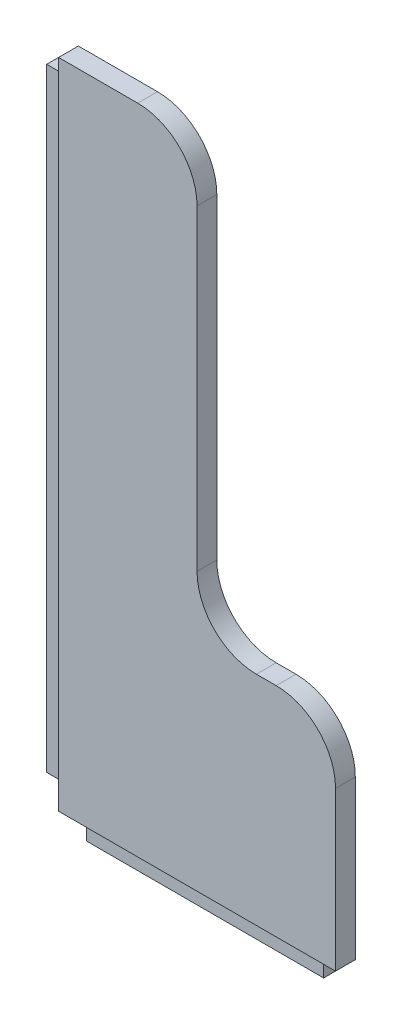
ISO-10303-21;
HEADER;
FILE_DESCRIPTION(('STEP AP214'),'2;1');
FILE_NAME('part.step','',(''),(''),'','','');
FILE_SCHEMA(('AUTOMOTIVE_DESIGN { 1 0 10303 214 1 1 1 1 }'));
ENDSEC;
DATA;
#1=APPLICATION_CONTEXT('core data for automotive mechanical design processes');
#2=APPLICATION_PROTOCOL_DEFINITION('international standard','automotive_design',2000,#1);
#3=PRODUCT_CONTEXT('',#1,'mechanical');
#4=PRODUCT('Part','Part','',(#3));
#5=PRODUCT_RELATED_PRODUCT_CATEGORY('part','',(#4));
#6=PRODUCT_DEFINITION_FORMATION('','',#4);
#7=PRODUCT_DEFINITION_CONTEXT('part definition',#1,'design');
#8=PRODUCT_DEFINITION('design','',#6,#7);
#9=PRODUCT_DEFINITION_SHAPE('','',#8);
#10=(LENGTH_UNIT() NAMED_UNIT(*) SI_UNIT(.MILLI.,.METRE.));
#11=(NAMED_UNIT(*) PLANE_ANGLE_UNIT() SI_UNIT($,.RADIAN.));
#12=(NAMED_UNIT(*) SI_UNIT($,.STERADIAN.) SOLID_ANGLE_UNIT());
#13=UNCERTAINTY_MEASURE_WITH_UNIT(LENGTH_MEASURE(1.E-05),#10,'distance_accuracy_value','');
#14=(GEOMETRIC_REPRESENTATION_CONTEXT(3) GLOBAL_UNCERTAINTY_ASSIGNED_CONTEXT((#13)) GLOBAL_UNIT_ASSIGNED_CONTEXT((#10,
#11,#12)) REPRESENTATION_CONTEXT('',''));
#15=CARTESIAN_POINT('',(0.,0.,0.));
#16=DIRECTION('',(0.,0.,1.));
#17=DIRECTION('',(1.,0.,0.));
#18=AXIS2_PLACEMENT_3D('',#15,#16,#17);
#19=CARTESIAN_POINT('',(-65.7510485640069,-44.9601181564782,228.958991852952));
#20=DIRECTION('',(0.,1.,0.));
#21=DIRECTION('',(0.,0.,1.));
#22=AXIS2_PLACEMENT_3D('',#19,#20,#21);
#23=PLANE('',#22);
#24=DIRECTION('',(0.,0.,-1.));
#25=VECTOR('',#24,1.);
#26=CARTESIAN_POINT('',(-141.951048564007,-44.9601181564782,222.608991852952));
#27=LINE('',#26,#25);
#28=CARTESIAN_POINT('',(-141.951048564007,-44.9601181564782,226.418991852952));
#29=VERTEX_POINT('',#28);
#30=CARTESIAN_POINT('',(-141.951048564007,-44.9601181564782,222.608991852952));
#31=VERTEX_POINT('',#30);
#32=EDGE_CURVE('E46',#29,#31,#27,.T.);
#33=ORIENTED_EDGE('',*,*,#32,.F.);
#34=DIRECTION('',(-1.,0.,0.));
#35=VECTOR('',#34,1.);
#36=CARTESIAN_POINT('',(-141.951048564007,-44.9601181564782,226.418991852952));
#37=LINE('',#36,#35);
#38=CARTESIAN_POINT('',(-65.751048564007,-44.9601181564782,226.418991852952));
#39=VERTEX_POINT('',#38);
#40=EDGE_CURVE('E169',#39,#29,#37,.T.);
#41=ORIENTED_EDGE('',*,*,#40,.F.);
#42=DIRECTION('',(0.,0.,1.));
#43=VECTOR('',#42,1.);
#44=CARTESIAN_POINT('',(-65.751048564007,-44.9601181564782,222.608991852952));
#45=LINE('',#44,#43);
#46=CARTESIAN_POINT('',(-65.751048564007,-44.9601181564782,222.608991852952));
#47=VERTEX_POINT('',#46);
#48=EDGE_CURVE('E52',#47,#39,#45,.T.);
#49=ORIENTED_EDGE('',*,*,#48,.F.);
#50=DIRECTION('',(1.,0.,0.));
#51=VECTOR('',#50,1.);
#52=CARTESIAN_POINT('',(-65.7510485640069,-44.9601181564782,222.608991852952));
#53=LINE('',#52,#51);
#54=CARTESIAN_POINT('',(-59.4010485640069,-44.9601181564782,222.608991852952));
#55=VERTEX_POINT('',#54);
#56=EDGE_CURVE('E207',#47,#55,#53,.T.);
#57=ORIENTED_EDGE('',*,*,#56,.T.);
#58=DIRECTION('',(0.,0.,-1.));
#59=VECTOR('',#58,1.);
#60=CARTESIAN_POINT('',(-59.4010485640069,-44.9601181564782,228.958991852952));
#61=LINE('',#60,#59);
#62=CARTESIAN_POINT('',(-59.4010485640069,-44.9601181564782,228.958991852952));
#63=VERTEX_POINT('',#62);
#64=EDGE_CURVE('E39',#63,#55,#61,.T.);
#65=ORIENTED_EDGE('',*,*,#64,.F.);
#66=DIRECTION('',(1.,0.,0.));
#67=VECTOR('',#66,1.);
#68=CARTESIAN_POINT('',(-148.301048564007,-44.9601181564782,228.958991852952));
#69=LINE('',#68,#67);
#70=CARTESIAN_POINT('',(-148.301048564007,-44.9601181564782,228.958991852952));
#71=VERTEX_POINT('',#70);
#72=EDGE_CURVE('E211',#71,#63,#69,.T.);
#73=ORIENTED_EDGE('',*,*,#72,.F.);
#74=DIRECTION('',(0.,0.,-1.));
#75=VECTOR('',#74,1.);
#76=CARTESIAN_POINT('',(-148.301048564007,-44.9601181564782,228.958991852952));
#77=LINE('',#76,#75);
#78=CARTESIAN_POINT('',(-148.301048564007,-44.9601181564782,222.608991852952));
#79=VERTEX_POINT('',#78);
#80=EDGE_CURVE('E11',#71,#79,#77,.T.);
#81=ORIENTED_EDGE('',*,*,#80,.T.);
#82=EDGE_CURVE('E230',#79,#31,#53,.T.);
#83=ORIENTED_EDGE('',*,*,#82,.T.);
#84=EDGE_LOOP('',(#33,#41,#49,#57,#65,#73,#81,#83));
#85=FACE_BOUND('',#84,.T.);
#86=ADVANCED_FACE('F32',(#85),#23,.F.);
#87=CARTESIAN_POINT('',(-148.301048564007,158.239881843522,228.958991852952));
#88=DIRECTION('',(1.,0.,0.));
#89=DIRECTION('',(0.,0.,-1.));
#90=AXIS2_PLACEMENT_3D('',#87,#88,#89);
#91=PLANE('',#90);
#92=DIRECTION('',(0.,0.,-1.));
#93=VECTOR('',#92,1.);
#94=CARTESIAN_POINT('',(-148.301048564007,158.239881843522,222.608991852952));
#95=LINE('',#94,#93);
#96=CARTESIAN_POINT('',(-148.301048564007,158.239881843522,226.418991852952));
#97=VERTEX_POINT('',#96);
#98=CARTESIAN_POINT('',(-148.301048564007,158.239881843522,222.608991852952));
#99=VERTEX_POINT('',#98);
#100=EDGE_CURVE('E185',#97,#99,#95,.T.);
#101=ORIENTED_EDGE('',*,*,#100,.F.);
#102=DIRECTION('',(0.,1.,0.));
#103=VECTOR('',#102,1.);
#104=CARTESIAN_POINT('',(-148.301048564007,-38.6101181564782,226.418991852952));
#105=LINE('',#104,#103);
#106=CARTESIAN_POINT('',(-148.301048564007,-38.6101181564782,226.418991852952));
#107=VERTEX_POINT('',#106);
#108=EDGE_CURVE('E175',#107,#97,#105,.T.);
#109=ORIENTED_EDGE('',*,*,#108,.F.);
#110=DIRECTION('',(0.,0.,1.));
#111=VECTOR('',#110,1.);
#112=CARTESIAN_POINT('',(-148.301048564007,-38.6101181564782,222.608991852952));
#113=LINE('',#112,#111);
#114=CARTESIAN_POINT('',(-148.301048564007,-38.6101181564782,222.608991852952));
#115=VERTEX_POINT('',#114);
#116=EDGE_CURVE('E172',#115,#107,#113,.T.);
#117=ORIENTED_EDGE('',*,*,#116,.F.);
#118=DIRECTION('',(0.,-1.,0.));
#119=VECTOR('',#118,1.);
#120=CARTESIAN_POINT('',(-148.301048564007,158.239881843522,222.608991852952));
#121=LINE('',#120,#119);
#122=EDGE_CURVE('E246',#115,#79,#121,.T.);
#123=ORIENTED_EDGE('',*,*,#122,.T.);
#124=ORIENTED_EDGE('',*,*,#80,.F.);
#125=DIRECTION('',(0.,-1.,0.));
#126=VECTOR('',#125,1.);
#127=CARTESIAN_POINT('',(-148.301048564007,-44.9601181564782,228.958991852952));
#128=LINE('',#127,#126);
#129=CARTESIAN_POINT('',(-148.301048564007,164.589881843522,228.958991852952));
#130=VERTEX_POINT('',#129);
#131=EDGE_CURVE('E208',#130,#71,#128,.T.);
#132=ORIENTED_EDGE('',*,*,#131,.F.);
#133=DIRECTION('',(0.,0.,-1.));
#134=VECTOR('',#133,1.);
#135=CARTESIAN_POINT('',(-148.301048564007,164.589881843522,228.958991852952));
#136=LINE('',#135,#134);
#137=CARTESIAN_POINT('',(-148.301048564007,164.589881843522,222.608991852952));
#138=VERTEX_POINT('',#137);
#139=EDGE_CURVE('E229',#130,#138,#136,.T.);
#140=ORIENTED_EDGE('',*,*,#139,.T.);
#141=EDGE_CURVE('E212',#138,#99,#121,.T.);
#142=ORIENTED_EDGE('',*,*,#141,.T.);
#143=EDGE_LOOP('',(#101,#109,#117,#123,#124,#132,#140,#142));
#144=FACE_BOUND('',#143,.T.);
#145=ADVANCED_FACE('F291',(#144),#91,.F.);
#146=CARTESIAN_POINT('',(-122.901048564007,145.539881843522,222.608991852952));
#147=DIRECTION('',(0.,0.,-1.));
#148=DIRECTION('',(-1.,0.,0.));
#149=AXIS2_PLACEMENT_3D('',#146,#147,#148);
#150=PLANE('',#149);
#151=ORIENTED_EDGE('',*,*,#82,.F.);
#152=ORIENTED_EDGE('',*,*,#122,.F.);
#153=DIRECTION('',(1.,0.,0.));
#154=VECTOR('',#153,1.);
#155=CARTESIAN_POINT('',(-154.651048564007,-38.6101181564782,222.608991852952));
#156=LINE('',#155,#154);
#157=CARTESIAN_POINT('',(-154.651048564007,-38.6101181564782,222.608991852952));
#158=VERTEX_POINT('',#157);
#159=EDGE_CURVE('E204',#158,#115,#156,.T.);
#160=ORIENTED_EDGE('',*,*,#159,.F.);
#161=DIRECTION('',(0.,-1.,0.));
#162=VECTOR('',#161,1.);
#163=CARTESIAN_POINT('',(-154.651048564007,-38.6101181564782,222.608991852952));
#164=LINE('',#163,#162);
#165=CARTESIAN_POINT('',(-154.651048564007,158.239881843522,222.608991852952));
#166=VERTEX_POINT('',#165);
#167=EDGE_CURVE('E181',#166,#158,#164,.T.);
#168=ORIENTED_EDGE('',*,*,#167,.F.);
#169=DIRECTION('',(1.,0.,0.));
#170=VECTOR('',#169,1.);
#171=CARTESIAN_POINT('',(-154.651048564007,158.239881843522,222.608991852952));
#172=LINE('',#171,#170);
#173=EDGE_CURVE('E190',#166,#99,#172,.T.);
#174=ORIENTED_EDGE('',*,*,#173,.T.);
#175=ORIENTED_EDGE('',*,*,#141,.F.);
#176=DIRECTION('',(-1.,0.,0.));
#177=VECTOR('',#176,1.);
#178=CARTESIAN_POINT('',(-148.301048564007,164.589881843522,222.608991852952));
#179=LINE('',#178,#177);
#180=CARTESIAN_POINT('',(-122.901048564007,164.589881843522,222.608991852952));
#181=VERTEX_POINT('',#180);
#182=EDGE_CURVE('E244',#181,#138,#179,.T.);
#183=ORIENTED_EDGE('',*,*,#182,.F.);
#184=CARTESIAN_POINT('',(-122.901048564007,145.539881843522,222.608991852952));
#185=DIRECTION('',(0.,0.,1.));
#186=DIRECTION('',(-1.,0.,0.));
#187=AXIS2_PLACEMENT_3D('',#184,#185,#186);
#188=CIRCLE('',#187,19.05);
#189=CARTESIAN_POINT('',(-103.851048564007,145.539881843522,222.608991852952));
#190=VERTEX_POINT('',#189);
#191=EDGE_CURVE('E242',#190,#181,#188,.T.);
#192=ORIENTED_EDGE('',*,*,#191,.F.);
#193=DIRECTION('',(0.,1.,0.));
#194=VECTOR('',#193,1.);
#195=CARTESIAN_POINT('',(-103.851048564007,145.539881843522,222.608991852952));
#196=LINE('',#195,#194);
#197=CARTESIAN_POINT('',(-103.851048564007,43.9398818435219,222.608991852952));
#198=VERTEX_POINT('',#197);
#199=EDGE_CURVE('E240',#198,#190,#196,.T.);
#200=ORIENTED_EDGE('',*,*,#199,.F.);
#201=CARTESIAN_POINT('',(-84.8010485640069,43.9398818435218,222.608991852952));
#202=DIRECTION('',(0.,0.,-1.));
#203=DIRECTION('',(1.,0.,0.));
#204=AXIS2_PLACEMENT_3D('',#201,#202,#203);
#205=CIRCLE('',#204,19.05);
#206=CARTESIAN_POINT('',(-84.8010485640068,24.8898818435218,222.608991852952));
#207=VERTEX_POINT('',#206);
#208=EDGE_CURVE('E238',#207,#198,#205,.T.);
#209=ORIENTED_EDGE('',*,*,#208,.F.);
#210=DIRECTION('',(-1.,0.,0.));
#211=VECTOR('',#210,1.);
#212=CARTESIAN_POINT('',(-84.8010485640068,24.8898818435218,222.608991852952));
#213=LINE('',#212,#211);
#214=CARTESIAN_POINT('',(-78.4510485640071,24.8898818435218,222.608991852952));
#215=VERTEX_POINT('',#214);
#216=EDGE_CURVE('E236',#215,#207,#213,.T.);
#217=ORIENTED_EDGE('',*,*,#216,.F.);
#218=CARTESIAN_POINT('',(-78.451048564007,5.83988184352181,222.608991852952));
#219=DIRECTION('',(0.,0.,1.));
#220=DIRECTION('',(-1.,0.,0.));
#221=AXIS2_PLACEMENT_3D('',#218,#219,#220);
#222=CIRCLE('',#221,19.05);
#223=CARTESIAN_POINT('',(-59.4010485640069,5.83988184352167,222.608991852952));
#224=VERTEX_POINT('',#223);
#225=EDGE_CURVE('E234',#224,#215,#222,.T.);
#226=ORIENTED_EDGE('',*,*,#225,.F.);
#227=DIRECTION('',(0.,1.,0.));
#228=VECTOR('',#227,1.);
#229=CARTESIAN_POINT('',(-59.4010485640069,5.83988184352167,222.608991852952));
#230=LINE('',#229,#228);
#231=EDGE_CURVE('E232',#55,#224,#230,.T.);
#232=ORIENTED_EDGE('',*,*,#231,.F.);
#233=ORIENTED_EDGE('',*,*,#56,.F.);
#234=DIRECTION('',(0.,1.,0.));
#235=VECTOR('',#234,1.);
#236=CARTESIAN_POINT('',(-65.751048564007,-51.3101181564782,222.608991852952));
#237=LINE('',#236,#235);
#238=CARTESIAN_POINT('',(-65.751048564007,-51.3101181564782,222.608991852952));
#239=VERTEX_POINT('',#238);
#240=EDGE_CURVE('E156',#239,#47,#237,.T.);
#241=ORIENTED_EDGE('',*,*,#240,.F.);
#242=DIRECTION('',(1.,0.,0.));
#243=VECTOR('',#242,1.);
#244=CARTESIAN_POINT('',(-141.951048564007,-51.3101181564782,222.608991852952));
#245=LINE('',#244,#243);
#246=CARTESIAN_POINT('',(-141.951048564007,-51.3101181564782,222.608991852952));
#247=VERTEX_POINT('',#246);
#248=EDGE_CURVE('E149',#247,#239,#245,.T.);
#249=ORIENTED_EDGE('',*,*,#248,.F.);
#250=DIRECTION('',(0.,1.,0.));
#251=VECTOR('',#250,1.);
#252=CARTESIAN_POINT('',(-141.951048564007,-51.3101181564782,222.608991852952));
#253=LINE('',#252,#251);
#254=EDGE_CURVE('E154',#247,#31,#253,.T.);
#255=ORIENTED_EDGE('',*,*,#254,.T.);
#256=EDGE_LOOP('',(#151,#152,#160,#168,#174,#175,#183,#192,#200,#209,#217,#226,#232,#233,#241,
#249,#255));
#257=FACE_BOUND('',#256,.T.);
#258=ADVANCED_FACE('F152',(#257),#150,.T.);
#259=CARTESIAN_POINT('',(-59.4010485640069,5.83988184352167,228.958991852952));
#260=DIRECTION('',(-1.,0.,0.));
#261=DIRECTION('',(0.,0.,1.));
#262=AXIS2_PLACEMENT_3D('',#259,#260,#261);
#263=PLANE('',#262);
#264=ORIENTED_EDGE('',*,*,#231,.T.);
#265=DIRECTION('',(0.,0.,-1.));
#266=VECTOR('',#265,1.);
#267=CARTESIAN_POINT('',(-59.4010485640069,5.83988184352167,228.958991852952));
#268=LINE('',#267,#266);
#269=CARTESIAN_POINT('',(-59.4010485640069,5.83988184352167,228.958991852952));
#270=VERTEX_POINT('',#269);
#271=EDGE_CURVE('E265',#270,#224,#268,.T.);
#272=ORIENTED_EDGE('',*,*,#271,.F.);
#273=DIRECTION('',(0.,1.,0.));
#274=VECTOR('',#273,1.);
#275=CARTESIAN_POINT('',(-59.4010485640069,5.83988184352167,228.958991852952));
#276=LINE('',#275,#274);
#277=EDGE_CURVE('E214',#63,#270,#276,.T.);
#278=ORIENTED_EDGE('',*,*,#277,.F.);
#279=ORIENTED_EDGE('',*,*,#64,.T.);
#280=EDGE_LOOP('',(#264,#272,#278,#279));
#281=FACE_BOUND('',#280,.T.);
#282=ADVANCED_FACE('F272',(#281),#263,.F.);
#283=CARTESIAN_POINT('',(-78.451048564007,5.83988184352181,228.958991852952));
#284=DIRECTION('',(0.,0.,-1.));
#285=DIRECTION('',(-1.,0.,0.));
#286=AXIS2_PLACEMENT_3D('',#283,#284,#285);
#287=CYLINDRICAL_SURFACE('',#286,19.05);
#288=ORIENTED_EDGE('',*,*,#225,.T.);
#289=DIRECTION('',(0.,0.,-1.));
#290=VECTOR('',#289,1.);
#291=CARTESIAN_POINT('',(-78.4510485640071,24.8898818435218,228.958991852952));
#292=LINE('',#291,#290);
#293=CARTESIAN_POINT('',(-78.4510485640071,24.8898818435218,228.958991852952));
#294=VERTEX_POINT('',#293);
#295=EDGE_CURVE('E262',#294,#215,#292,.T.);
#296=ORIENTED_EDGE('',*,*,#295,.F.);
#297=CARTESIAN_POINT('',(-78.451048564007,5.83988184352181,228.958991852952));
#298=DIRECTION('',(0.,0.,1.));
#299=DIRECTION('',(-1.,0.,0.));
#300=AXIS2_PLACEMENT_3D('',#297,#298,#299);
#301=CIRCLE('',#300,19.05);
#302=EDGE_CURVE('E216',#270,#294,#301,.T.);
#303=ORIENTED_EDGE('',*,*,#302,.F.);
#304=ORIENTED_EDGE('',*,*,#271,.T.);
#305=EDGE_LOOP('',(#288,#296,#303,#304));
#306=FACE_BOUND('',#305,.T.);
#307=ADVANCED_FACE('F279',(#306),#287,.T.);
#308=CARTESIAN_POINT('',(-84.8010485640068,24.8898818435218,228.958991852952));
#309=DIRECTION('',(0.,-1.,0.));
#310=DIRECTION('',(0.,0.,-1.));
#311=AXIS2_PLACEMENT_3D('',#308,#309,#310);
#312=PLANE('',#311);
#313=ORIENTED_EDGE('',*,*,#216,.T.);
#314=DIRECTION('',(0.,0.,-1.));
#315=VECTOR('',#314,1.);
#316=CARTESIAN_POINT('',(-84.8010485640068,24.8898818435218,228.958991852952));
#317=LINE('',#316,#315);
#318=CARTESIAN_POINT('',(-84.8010485640068,24.8898818435218,228.958991852952));
#319=VERTEX_POINT('',#318);
#320=EDGE_CURVE('E259',#319,#207,#317,.T.);
#321=ORIENTED_EDGE('',*,*,#320,.F.);
#322=DIRECTION('',(-1.,0.,0.));
#323=VECTOR('',#322,1.);
#324=CARTESIAN_POINT('',(-84.8010485640068,24.8898818435218,228.958991852952));
#325=LINE('',#324,#323);
#326=EDGE_CURVE('E218',#294,#319,#325,.T.);
#327=ORIENTED_EDGE('',*,*,#326,.F.);
#328=ORIENTED_EDGE('',*,*,#295,.T.);
#329=EDGE_LOOP('',(#313,#321,#327,#328));
#330=FACE_BOUND('',#329,.T.);
#331=ADVANCED_FACE('F283',(#330),#312,.F.);
#332=CARTESIAN_POINT('',(-84.8010485640069,43.9398818435218,228.958991852952));
#333=DIRECTION('',(0.,0.,-1.));
#334=DIRECTION('',(-1.,0.,0.));
#335=AXIS2_PLACEMENT_3D('',#332,#333,#334);
#336=CYLINDRICAL_SURFACE('',#335,19.05);
#337=ORIENTED_EDGE('',*,*,#208,.T.);
#338=DIRECTION('',(0.,0.,-1.));
#339=VECTOR('',#338,1.);
#340=CARTESIAN_POINT('',(-103.851048564007,43.9398818435219,228.958991852952));
#341=LINE('',#340,#339);
#342=CARTESIAN_POINT('',(-103.851048564007,43.9398818435219,228.958991852952));
#343=VERTEX_POINT('',#342);
#344=EDGE_CURVE('E256',#343,#198,#341,.T.);
#345=ORIENTED_EDGE('',*,*,#344,.F.);
#346=CARTESIAN_POINT('',(-84.8010485640069,43.9398818435218,228.958991852952));
#347=DIRECTION('',(0.,0.,-1.));
#348=DIRECTION('',(1.,0.,0.));
#349=AXIS2_PLACEMENT_3D('',#346,#347,#348);
#350=CIRCLE('',#349,19.05);
#351=EDGE_CURVE('E220',#319,#343,#350,.T.);
#352=ORIENTED_EDGE('',*,*,#351,.F.);
#353=ORIENTED_EDGE('',*,*,#320,.T.);
#354=EDGE_LOOP('',(#337,#345,#352,#353));
#355=FACE_BOUND('',#354,.T.);
#356=ADVANCED_FACE('F340',(#355),#336,.F.);
#357=CARTESIAN_POINT('',(-103.851048564007,145.539881843522,228.958991852952));
#358=DIRECTION('',(-1.,0.,0.));
#359=DIRECTION('',(0.,-1.,0.));
#360=AXIS2_PLACEMENT_3D('',#357,#358,#359);
#361=PLANE('',#360);
#362=ORIENTED_EDGE('',*,*,#199,.T.);
#363=DIRECTION('',(0.,0.,-1.));
#364=VECTOR('',#363,1.);
#365=CARTESIAN_POINT('',(-103.851048564007,145.539881843522,228.958991852952));
#366=LINE('',#365,#364);
#367=CARTESIAN_POINT('',(-103.851048564007,145.539881843522,228.958991852952));
#368=VERTEX_POINT('',#367);
#369=EDGE_CURVE('E253',#368,#190,#366,.T.);
#370=ORIENTED_EDGE('',*,*,#369,.F.);
#371=DIRECTION('',(0.,1.,0.));
#372=VECTOR('',#371,1.);
#373=CARTESIAN_POINT('',(-103.851048564007,145.539881843522,228.958991852952));
#374=LINE('',#373,#372);
#375=EDGE_CURVE('E222',#343,#368,#374,.T.);
#376=ORIENTED_EDGE('',*,*,#375,.F.);
#377=ORIENTED_EDGE('',*,*,#344,.T.);
#378=EDGE_LOOP('',(#362,#370,#376,#377));
#379=FACE_BOUND('',#378,.T.);
#380=ADVANCED_FACE('F336',(#379),#361,.F.);
#381=CARTESIAN_POINT('',(-122.901048564007,145.539881843522,228.958991852952));
#382=DIRECTION('',(0.,0.,-1.));
#383=DIRECTION('',(-1.,0.,0.));
#384=AXIS2_PLACEMENT_3D('',#381,#382,#383);
#385=CYLINDRICAL_SURFACE('',#384,19.05);
#386=ORIENTED_EDGE('',*,*,#191,.T.);
#387=DIRECTION('',(0.,0.,-1.));
#388=VECTOR('',#387,1.);
#389=CARTESIAN_POINT('',(-122.901048564007,164.589881843522,228.958991852952));
#390=LINE('',#389,#388);
#391=CARTESIAN_POINT('',(-122.901048564007,164.589881843522,228.958991852952));
#392=VERTEX_POINT('',#391);
#393=EDGE_CURVE('E250',#392,#181,#390,.T.);
#394=ORIENTED_EDGE('',*,*,#393,.F.);
#395=CARTESIAN_POINT('',(-122.901048564007,145.539881843522,228.958991852952));
#396=DIRECTION('',(0.,0.,1.));
#397=DIRECTION('',(-1.,0.,0.));
#398=AXIS2_PLACEMENT_3D('',#395,#396,#397);
#399=CIRCLE('',#398,19.05);
#400=EDGE_CURVE('E224',#368,#392,#399,.T.);
#401=ORIENTED_EDGE('',*,*,#400,.F.);
#402=ORIENTED_EDGE('',*,*,#369,.T.);
#403=EDGE_LOOP('',(#386,#394,#401,#402));
#404=FACE_BOUND('',#403,.T.);
#405=ADVANCED_FACE('F332',(#404),#385,.T.);
#406=CARTESIAN_POINT('',(-148.301048564007,164.589881843522,228.958991852952));
#407=DIRECTION('',(0.,-1.,0.));
#408=DIRECTION('',(0.,0.,-1.));
#409=AXIS2_PLACEMENT_3D('',#406,#407,#408);
#410=PLANE('',#409);
#411=ORIENTED_EDGE('',*,*,#182,.T.);
#412=ORIENTED_EDGE('',*,*,#139,.F.);
#413=DIRECTION('',(-1.,0.,0.));
#414=VECTOR('',#413,1.);
#415=CARTESIAN_POINT('',(-148.301048564007,164.589881843522,228.958991852952));
#416=LINE('',#415,#414);
#417=EDGE_CURVE('E226',#392,#130,#416,.T.);
#418=ORIENTED_EDGE('',*,*,#417,.F.);
#419=ORIENTED_EDGE('',*,*,#393,.T.);
#420=EDGE_LOOP('',(#411,#412,#418,#419));
#421=FACE_BOUND('',#420,.T.);
#422=ADVANCED_FACE('F329',(#421),#410,.F.);
#423=CARTESIAN_POINT('',(-122.901048564007,145.539881843522,228.958991852952));
#424=DIRECTION('',(0.,0.,-1.));
#425=DIRECTION('',(-1.,0.,0.));
#426=AXIS2_PLACEMENT_3D('',#423,#424,#425);
#427=PLANE('',#426);
#428=ORIENTED_EDGE('',*,*,#417,.T.);
#429=ORIENTED_EDGE('',*,*,#131,.T.);
#430=ORIENTED_EDGE('',*,*,#72,.T.);
#431=ORIENTED_EDGE('',*,*,#277,.T.);
#432=ORIENTED_EDGE('',*,*,#302,.T.);
#433=ORIENTED_EDGE('',*,*,#326,.T.);
#434=ORIENTED_EDGE('',*,*,#351,.T.);
#435=ORIENTED_EDGE('',*,*,#375,.T.);
#436=ORIENTED_EDGE('',*,*,#400,.T.);
#437=EDGE_LOOP('',(#428,#429,#430,#431,#432,#433,#434,#435,#436));
#438=FACE_BOUND('',#437,.T.);
#439=ADVANCED_FACE('F287',(#438),#427,.F.);
#440=CARTESIAN_POINT('',(-154.651048564007,-38.6101181564782,222.608991852952));
#441=DIRECTION('',(0.,1.,0.));
#442=DIRECTION('',(0.,0.,1.));
#443=AXIS2_PLACEMENT_3D('',#440,#441,#442);
#444=PLANE('',#443);
#445=ORIENTED_EDGE('',*,*,#116,.T.);
#446=DIRECTION('',(1.,0.,0.));
#447=VECTOR('',#446,1.);
#448=CARTESIAN_POINT('',(-154.651048564007,-38.6101181564782,226.418991852952));
#449=LINE('',#448,#447);
#450=CARTESIAN_POINT('',(-154.651048564007,-38.6101181564782,226.418991852952));
#451=VERTEX_POINT('',#450);
#452=EDGE_CURVE('E201',#451,#107,#449,.T.);
#453=ORIENTED_EDGE('',*,*,#452,.F.);
#454=DIRECTION('',(0.,0.,1.));
#455=VECTOR('',#454,1.);
#456=CARTESIAN_POINT('',(-154.651048564007,-38.6101181564782,222.608991852952));
#457=LINE('',#456,#455);
#458=EDGE_CURVE('E184',#158,#451,#457,.T.);
#459=ORIENTED_EDGE('',*,*,#458,.F.);
#460=ORIENTED_EDGE('',*,*,#159,.T.);
#461=EDGE_LOOP('',(#445,#453,#459,#460));
#462=FACE_BOUND('',#461,.T.);
#463=ADVANCED_FACE('F296',(#462),#444,.F.);
#464=CARTESIAN_POINT('',(-154.651048564007,-38.6101181564782,226.418991852952));
#465=DIRECTION('',(0.,0.,-1.));
#466=DIRECTION('',(-1.,0.,0.));
#467=AXIS2_PLACEMENT_3D('',#464,#465,#466);
#468=PLANE('',#467);
#469=ORIENTED_EDGE('',*,*,#108,.T.);
#470=DIRECTION('',(1.,0.,0.));
#471=VECTOR('',#470,1.);
#472=CARTESIAN_POINT('',(-154.651048564007,158.239881843522,226.418991852952));
#473=LINE('',#472,#471);
#474=CARTESIAN_POINT('',(-154.651048564007,158.239881843522,226.418991852952));
#475=VERTEX_POINT('',#474);
#476=EDGE_CURVE('E198',#475,#97,#473,.T.);
#477=ORIENTED_EDGE('',*,*,#476,.F.);
#478=DIRECTION('',(0.,1.,0.));
#479=VECTOR('',#478,1.);
#480=CARTESIAN_POINT('',(-154.651048564007,-38.6101181564782,226.418991852952));
#481=LINE('',#480,#479);
#482=EDGE_CURVE('E187',#451,#475,#481,.T.);
#483=ORIENTED_EDGE('',*,*,#482,.F.);
#484=ORIENTED_EDGE('',*,*,#452,.T.);
#485=EDGE_LOOP('',(#469,#477,#483,#484));
#486=FACE_BOUND('',#485,.T.);
#487=ADVANCED_FACE('F309',(#486),#468,.F.);
#488=CARTESIAN_POINT('',(-154.651048564007,158.239881843522,222.608991852952));
#489=DIRECTION('',(0.,-1.,0.));
#490=DIRECTION('',(0.,0.,-1.));
#491=AXIS2_PLACEMENT_3D('',#488,#489,#490);
#492=PLANE('',#491);
#493=ORIENTED_EDGE('',*,*,#100,.T.);
#494=ORIENTED_EDGE('',*,*,#173,.F.);
#495=DIRECTION('',(0.,0.,-1.));
#496=VECTOR('',#495,1.);
#497=CARTESIAN_POINT('',(-154.651048564007,158.239881843522,222.608991852952));
#498=LINE('',#497,#496);
#499=EDGE_CURVE('E189',#475,#166,#498,.T.);
#500=ORIENTED_EDGE('',*,*,#499,.F.);
#501=ORIENTED_EDGE('',*,*,#476,.T.);
#502=EDGE_LOOP('',(#493,#494,#500,#501));
#503=FACE_BOUND('',#502,.T.);
#504=ADVANCED_FACE('F306',(#503),#492,.F.);
#505=CARTESIAN_POINT('',(-154.651048564007,0.,0.));
#506=DIRECTION('',(1.,0.,0.));
#507=DIRECTION('',(0.,0.,-1.));
#508=AXIS2_PLACEMENT_3D('',#505,#506,#507);
#509=PLANE('',#508);
#510=ORIENTED_EDGE('',*,*,#167,.T.);
#511=ORIENTED_EDGE('',*,*,#458,.T.);
#512=ORIENTED_EDGE('',*,*,#482,.T.);
#513=ORIENTED_EDGE('',*,*,#499,.T.);
#514=EDGE_LOOP('',(#510,#511,#512,#513));
#515=FACE_BOUND('',#514,.T.);
#516=ADVANCED_FACE('F300',(#515),#509,.F.);
#517=CARTESIAN_POINT('',(-141.951048564007,-51.3101181564782,222.608991852952));
#518=DIRECTION('',(1.,0.,0.));
#519=DIRECTION('',(0.,0.,-1.));
#520=AXIS2_PLACEMENT_3D('',#517,#518,#519);
#521=PLANE('',#520);
#522=ORIENTED_EDGE('',*,*,#32,.T.);
#523=ORIENTED_EDGE('',*,*,#254,.F.);
#524=DIRECTION('',(0.,0.,-1.));
#525=VECTOR('',#524,1.);
#526=CARTESIAN_POINT('',(-141.951048564007,-51.3101181564782,222.608991852952));
#527=LINE('',#526,#525);
#528=CARTESIAN_POINT('',(-141.951048564007,-51.3101181564782,226.418991852952));
#529=VERTEX_POINT('',#528);
#530=EDGE_CURVE('E160',#529,#247,#527,.T.);
#531=ORIENTED_EDGE('',*,*,#530,.F.);
#532=DIRECTION('',(0.,1.,0.));
#533=VECTOR('',#532,1.);
#534=CARTESIAN_POINT('',(-141.951048564007,-51.3101181564782,226.418991852952));
#535=LINE('',#534,#533);
#536=EDGE_CURVE('E458',#529,#29,#535,.T.);
#537=ORIENTED_EDGE('',*,*,#536,.T.);
#538=EDGE_LOOP('',(#522,#523,#531,#537));
#539=FACE_BOUND('',#538,.T.);
#540=ADVANCED_FACE('F171',(#539),#521,.F.);
#541=CARTESIAN_POINT('',(-65.751048564007,-51.3101181564782,222.608991852952));
#542=DIRECTION('',(-1.,0.,0.));
#543=DIRECTION('',(0.,0.,1.));
#544=AXIS2_PLACEMENT_3D('',#541,#542,#543);
#545=PLANE('',#544);
#546=ORIENTED_EDGE('',*,*,#48,.T.);
#547=DIRECTION('',(0.,1.,0.));
#548=VECTOR('',#547,1.);
#549=CARTESIAN_POINT('',(-65.751048564007,-51.3101181564782,226.418991852952));
#550=LINE('',#549,#548);
#551=CARTESIAN_POINT('',(-65.751048564007,-51.3101181564782,226.418991852952));
#552=VERTEX_POINT('',#551);
#553=EDGE_CURVE('E177',#552,#39,#550,.T.);
#554=ORIENTED_EDGE('',*,*,#553,.F.);
#555=DIRECTION('',(0.,0.,1.));
#556=VECTOR('',#555,1.);
#557=CARTESIAN_POINT('',(-65.751048564007,-51.3101181564782,222.608991852952));
#558=LINE('',#557,#556);
#559=EDGE_CURVE('E159',#239,#552,#558,.T.);
#560=ORIENTED_EDGE('',*,*,#559,.F.);
#561=ORIENTED_EDGE('',*,*,#240,.T.);
#562=EDGE_LOOP('',(#546,#554,#560,#561));
#563=FACE_BOUND('',#562,.T.);
#564=ADVANCED_FACE('F426',(#563),#545,.F.);
#565=CARTESIAN_POINT('',(-141.951048564007,-51.3101181564782,226.418991852952));
#566=DIRECTION('',(0.,0.,-1.));
#567=DIRECTION('',(-1.,0.,0.));
#568=AXIS2_PLACEMENT_3D('',#565,#566,#567);
#569=PLANE('',#568);
#570=ORIENTED_EDGE('',*,*,#40,.T.);
#571=ORIENTED_EDGE('',*,*,#536,.F.);
#572=DIRECTION('',(-1.,0.,0.));
#573=VECTOR('',#572,1.);
#574=CARTESIAN_POINT('',(-141.951048564007,-51.3101181564782,226.418991852952));
#575=LINE('',#574,#573);
#576=EDGE_CURVE('E165',#552,#529,#575,.T.);
#577=ORIENTED_EDGE('',*,*,#576,.F.);
#578=ORIENTED_EDGE('',*,*,#553,.T.);
#579=EDGE_LOOP('',(#570,#571,#577,#578));
#580=FACE_BOUND('',#579,.T.);
#581=ADVANCED_FACE('F435',(#580),#569,.F.);
#582=CARTESIAN_POINT('',(0.,-51.3101181564782,0.));
#583=DIRECTION('',(0.,1.,0.));
#584=DIRECTION('',(0.,0.,1.));
#585=AXIS2_PLACEMENT_3D('',#582,#583,#584);
#586=PLANE('',#585);
#587=ORIENTED_EDGE('',*,*,#530,.T.);
#588=ORIENTED_EDGE('',*,*,#248,.T.);
#589=ORIENTED_EDGE('',*,*,#559,.T.);
#590=ORIENTED_EDGE('',*,*,#576,.T.);
#591=EDGE_LOOP('',(#587,#588,#589,#590));
#592=FACE_BOUND('',#591,.T.);
#593=ADVANCED_FACE('F163',(#592),#586,.F.);
#594=CLOSED_SHELL('',(#86,#145,#258,#282,#307,#331,#356,#380,#405,#422,#439,#463,#487,#504,#516,
#540,#564,#581,#593));
#595=MANIFOLD_SOLID_BREP('B2',#594);
#596=ADVANCED_BREP_SHAPE_REPRESENTATION('',(#18,#595),#14);
#597=SHAPE_DEFINITION_REPRESENTATION(#9,#596);
ENDSEC;
END-ISO-10303-21;
